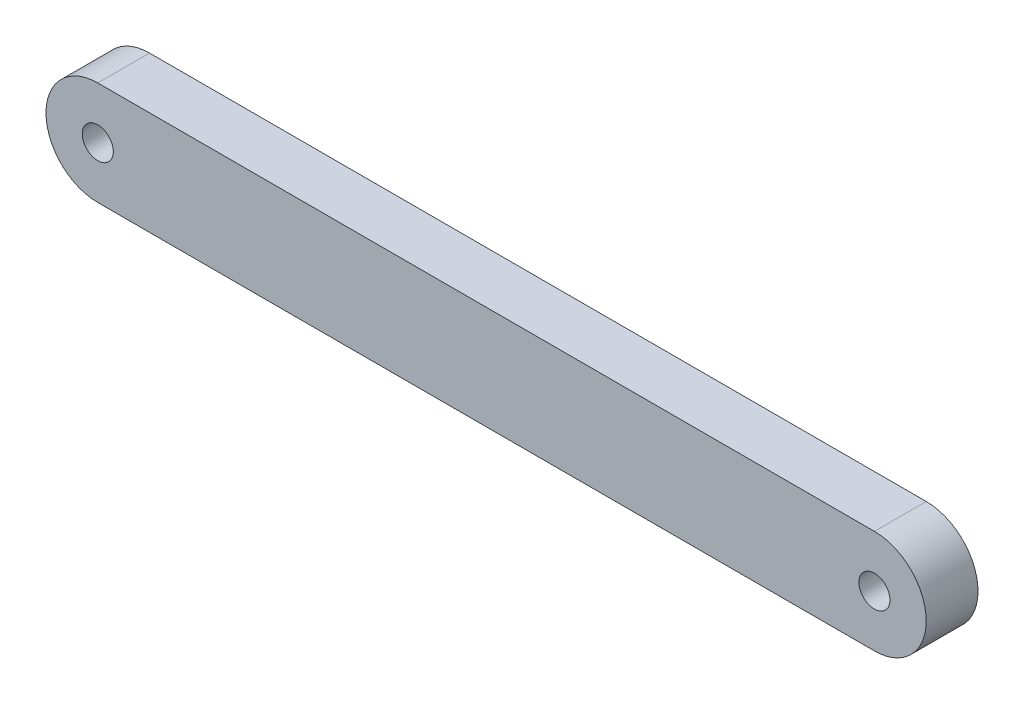
ISO-10303-21;
HEADER;
FILE_DESCRIPTION(('STEP AP214'),'2;1');
FILE_NAME('part.step','',(''),(''),'','','');
FILE_SCHEMA(('AUTOMOTIVE_DESIGN { 1 0 10303 214 1 1 1 1 }'));
ENDSEC;
DATA;
#1=APPLICATION_CONTEXT('core data for automotive mechanical design processes');
#2=APPLICATION_PROTOCOL_DEFINITION('international standard','automotive_design',2000,#1);
#3=PRODUCT_CONTEXT('',#1,'mechanical');
#4=PRODUCT('Part','Part','',(#3));
#5=PRODUCT_RELATED_PRODUCT_CATEGORY('part','',(#4));
#6=PRODUCT_DEFINITION_FORMATION('','',#4);
#7=PRODUCT_DEFINITION_CONTEXT('part definition',#1,'design');
#8=PRODUCT_DEFINITION('design','',#6,#7);
#9=PRODUCT_DEFINITION_SHAPE('','',#8);
#10=(LENGTH_UNIT() NAMED_UNIT(*) SI_UNIT(.MILLI.,.METRE.));
#11=(NAMED_UNIT(*) PLANE_ANGLE_UNIT() SI_UNIT($,.RADIAN.));
#12=(NAMED_UNIT(*) SI_UNIT($,.STERADIAN.) SOLID_ANGLE_UNIT());
#13=UNCERTAINTY_MEASURE_WITH_UNIT(LENGTH_MEASURE(1.E-05),#10,'distance_accuracy_value','');
#14=(GEOMETRIC_REPRESENTATION_CONTEXT(3) GLOBAL_UNCERTAINTY_ASSIGNED_CONTEXT((#13)) GLOBAL_UNIT_ASSIGNED_CONTEXT((#10,
#11,#12)) REPRESENTATION_CONTEXT('',''));
#15=CARTESIAN_POINT('',(0.,0.,0.));
#16=DIRECTION('',(0.,0.,1.));
#17=DIRECTION('',(1.,0.,0.));
#18=AXIS2_PLACEMENT_3D('',#15,#16,#17);
#19=CARTESIAN_POINT('',(-375.,0.,25.));
#20=DIRECTION('',(0.,0.,-1.));
#21=DIRECTION('',(-1.,0.,0.));
#22=AXIS2_PLACEMENT_3D('',#19,#20,#21);
#23=CYLINDRICAL_SURFACE('',#22,50.);
#24=CARTESIAN_POINT('',(-375.,0.,-25.));
#25=DIRECTION('',(0.,0.,1.));
#26=DIRECTION('',(1.,0.,0.));
#27=AXIS2_PLACEMENT_3D('',#24,#25,#26);
#28=CIRCLE('',#27,50.);
#29=CARTESIAN_POINT('',(-375.,50.,-25.));
#30=VERTEX_POINT('',#29);
#31=CARTESIAN_POINT('',(-375.,-50.,-25.));
#32=VERTEX_POINT('',#31);
#33=EDGE_CURVE('E100',#30,#32,#28,.T.);
#34=ORIENTED_EDGE('',*,*,#33,.T.);
#35=DIRECTION('',(0.,0.,-1.));
#36=VECTOR('',#35,1.);
#37=CARTESIAN_POINT('',(-375.,-50.,25.));
#38=LINE('',#37,#36);
#39=CARTESIAN_POINT('',(-375.,-50.,25.));
#40=VERTEX_POINT('',#39);
#41=EDGE_CURVE('E11',#40,#32,#38,.T.);
#42=ORIENTED_EDGE('',*,*,#41,.F.);
#43=CARTESIAN_POINT('',(-375.,0.,25.));
#44=DIRECTION('',(0.,0.,1.));
#45=DIRECTION('',(1.,0.,0.));
#46=AXIS2_PLACEMENT_3D('',#43,#44,#45);
#47=CIRCLE('',#46,50.);
#48=CARTESIAN_POINT('',(-375.,50.,25.));
#49=VERTEX_POINT('',#48);
#50=EDGE_CURVE('E88',#49,#40,#47,.T.);
#51=ORIENTED_EDGE('',*,*,#50,.F.);
#52=DIRECTION('',(0.,0.,-1.));
#53=VECTOR('',#52,1.);
#54=CARTESIAN_POINT('',(-375.,50.,25.));
#55=LINE('',#54,#53);
#56=EDGE_CURVE('E96',#49,#30,#55,.T.);
#57=ORIENTED_EDGE('',*,*,#56,.T.);
#58=EDGE_LOOP('',(#34,#42,#51,#57));
#59=FACE_BOUND('',#58,.T.);
#60=ADVANCED_FACE('F37',(#59),#23,.T.);
#61=CARTESIAN_POINT('',(-375.,-50.,25.));
#62=DIRECTION('',(0.,1.,0.));
#63=DIRECTION('',(0.,0.,1.));
#64=AXIS2_PLACEMENT_3D('',#61,#62,#63);
#65=PLANE('',#64);
#66=DIRECTION('',(1.,0.,0.));
#67=VECTOR('',#66,1.);
#68=CARTESIAN_POINT('',(-375.,-50.,-25.));
#69=LINE('',#68,#67);
#70=CARTESIAN_POINT('',(375.,-50.0000000000001,-25.));
#71=VERTEX_POINT('',#70);
#72=EDGE_CURVE('E92',#32,#71,#69,.T.);
#73=ORIENTED_EDGE('',*,*,#72,.T.);
#74=DIRECTION('',(0.,0.,-1.));
#75=VECTOR('',#74,1.);
#76=CARTESIAN_POINT('',(375.,-50.0000000000001,25.));
#77=LINE('',#76,#75);
#78=CARTESIAN_POINT('',(375.,-50.0000000000001,25.));
#79=VERTEX_POINT('',#78);
#80=EDGE_CURVE('E45',#79,#71,#77,.T.);
#81=ORIENTED_EDGE('',*,*,#80,.F.);
#82=DIRECTION('',(1.,0.,0.));
#83=VECTOR('',#82,1.);
#84=CARTESIAN_POINT('',(-375.,-50.,25.));
#85=LINE('',#84,#83);
#86=EDGE_CURVE('E83',#40,#79,#85,.T.);
#87=ORIENTED_EDGE('',*,*,#86,.F.);
#88=ORIENTED_EDGE('',*,*,#41,.T.);
#89=EDGE_LOOP('',(#73,#81,#87,#88));
#90=FACE_BOUND('',#89,.T.);
#91=ADVANCED_FACE('F91',(#90),#65,.F.);
#92=CARTESIAN_POINT('',(375.,0.,25.));
#93=DIRECTION('',(0.,0.,-1.));
#94=DIRECTION('',(-1.,0.,0.));
#95=AXIS2_PLACEMENT_3D('',#92,#93,#94);
#96=CYLINDRICAL_SURFACE('',#95,50.0000000000001);
#97=CARTESIAN_POINT('',(375.,0.,-25.));
#98=DIRECTION('',(0.,0.,1.));
#99=DIRECTION('',(1.,0.,0.));
#100=AXIS2_PLACEMENT_3D('',#97,#98,#99);
#101=CIRCLE('',#100,50.0000000000001);
#102=CARTESIAN_POINT('',(375.,50.0000000000002,-25.));
#103=VERTEX_POINT('',#102);
#104=EDGE_CURVE('E70',#71,#103,#101,.T.);
#105=ORIENTED_EDGE('',*,*,#104,.T.);
#106=DIRECTION('',(0.,0.,-1.));
#107=VECTOR('',#106,1.);
#108=CARTESIAN_POINT('',(375.,50.0000000000002,25.));
#109=LINE('',#108,#107);
#110=CARTESIAN_POINT('',(375.,50.0000000000002,25.));
#111=VERTEX_POINT('',#110);
#112=EDGE_CURVE('E93',#111,#103,#109,.T.);
#113=ORIENTED_EDGE('',*,*,#112,.F.);
#114=CARTESIAN_POINT('',(375.,0.,25.));
#115=DIRECTION('',(0.,0.,1.));
#116=DIRECTION('',(1.,0.,0.));
#117=AXIS2_PLACEMENT_3D('',#114,#115,#116);
#118=CIRCLE('',#117,50.0000000000001);
#119=EDGE_CURVE('E86',#79,#111,#118,.T.);
#120=ORIENTED_EDGE('',*,*,#119,.F.);
#121=ORIENTED_EDGE('',*,*,#80,.T.);
#122=EDGE_LOOP('',(#105,#113,#120,#121));
#123=FACE_BOUND('',#122,.T.);
#124=ADVANCED_FACE('F94',(#123),#96,.T.);
#125=CARTESIAN_POINT('',(-375.,50.,25.));
#126=DIRECTION('',(0.,-1.,0.));
#127=DIRECTION('',(1.,0.,0.));
#128=AXIS2_PLACEMENT_3D('',#125,#126,#127);
#129=PLANE('',#128);
#130=DIRECTION('',(-1.,0.,0.));
#131=VECTOR('',#130,1.);
#132=CARTESIAN_POINT('',(-375.,50.,-25.));
#133=LINE('',#132,#131);
#134=EDGE_CURVE('E76',#103,#30,#133,.T.);
#135=ORIENTED_EDGE('',*,*,#134,.T.);
#136=ORIENTED_EDGE('',*,*,#56,.F.);
#137=DIRECTION('',(-1.,0.,0.));
#138=VECTOR('',#137,1.);
#139=CARTESIAN_POINT('',(-375.,50.,25.));
#140=LINE('',#139,#138);
#141=EDGE_CURVE('E53',#111,#49,#140,.T.);
#142=ORIENTED_EDGE('',*,*,#141,.F.);
#143=ORIENTED_EDGE('',*,*,#112,.T.);
#144=EDGE_LOOP('',(#135,#136,#142,#143));
#145=FACE_BOUND('',#144,.T.);
#146=ADVANCED_FACE('F108',(#145),#129,.F.);
#147=CARTESIAN_POINT('',(-375.,0.,25.));
#148=DIRECTION('',(0.,0.,1.));
#149=DIRECTION('',(1.,0.,0.));
#150=AXIS2_PLACEMENT_3D('',#147,#148,#149);
#151=PLANE('',#150);
#152=CARTESIAN_POINT('',(-375.,0.,25.));
#153=DIRECTION('',(0.,0.,1.));
#154=DIRECTION('',(1.,0.,0.));
#155=AXIS2_PLACEMENT_3D('',#152,#153,#154);
#156=CIRCLE('',#155,15.);
#157=CARTESIAN_POINT('',(-360.,0.,25.));
#158=VERTEX_POINT('',#157);
#159=EDGE_CURVE('E120',#158,#158,#156,.T.);
#160=ORIENTED_EDGE('',*,*,#159,.F.);
#161=EDGE_LOOP('',(#160));
#162=FACE_BOUND('',#161,.T.);
#163=CARTESIAN_POINT('',(375.,0.,25.));
#164=DIRECTION('',(0.,0.,1.));
#165=DIRECTION('',(1.,0.,0.));
#166=AXIS2_PLACEMENT_3D('',#163,#164,#165);
#167=CIRCLE('',#166,15.);
#168=CARTESIAN_POINT('',(390.,0.,25.));
#169=VERTEX_POINT('',#168);
#170=EDGE_CURVE('E117',#169,#169,#167,.T.);
#171=ORIENTED_EDGE('',*,*,#170,.F.);
#172=EDGE_LOOP('',(#171));
#173=FACE_BOUND('',#172,.T.);
#174=ORIENTED_EDGE('',*,*,#50,.T.);
#175=ORIENTED_EDGE('',*,*,#86,.T.);
#176=ORIENTED_EDGE('',*,*,#119,.T.);
#177=ORIENTED_EDGE('',*,*,#141,.T.);
#178=EDGE_LOOP('',(#174,#175,#176,#177));
#179=FACE_BOUND('',#178,.T.);
#180=ADVANCED_FACE('F84',(#162,#173,#179),#151,.T.);
#181=CARTESIAN_POINT('',(-375.,0.,-25.));
#182=DIRECTION('',(0.,0.,1.));
#183=DIRECTION('',(1.,0.,0.));
#184=AXIS2_PLACEMENT_3D('',#181,#182,#183);
#185=PLANE('',#184);
#186=CARTESIAN_POINT('',(-375.,0.,-25.));
#187=DIRECTION('',(0.,0.,1.));
#188=DIRECTION('',(1.,0.,0.));
#189=AXIS2_PLACEMENT_3D('',#186,#187,#188);
#190=CIRCLE('',#189,15.);
#191=CARTESIAN_POINT('',(-360.,0.,-25.));
#192=VERTEX_POINT('',#191);
#193=EDGE_CURVE('E103',#192,#192,#190,.T.);
#194=ORIENTED_EDGE('',*,*,#193,.T.);
#195=EDGE_LOOP('',(#194));
#196=FACE_BOUND('',#195,.T.);
#197=CARTESIAN_POINT('',(375.,0.,-25.));
#198=DIRECTION('',(0.,0.,1.));
#199=DIRECTION('',(1.,0.,0.));
#200=AXIS2_PLACEMENT_3D('',#197,#198,#199);
#201=CIRCLE('',#200,15.);
#202=CARTESIAN_POINT('',(390.,0.,-25.));
#203=VERTEX_POINT('',#202);
#204=EDGE_CURVE('E114',#203,#203,#201,.T.);
#205=ORIENTED_EDGE('',*,*,#204,.T.);
#206=EDGE_LOOP('',(#205));
#207=FACE_BOUND('',#206,.T.);
#208=ORIENTED_EDGE('',*,*,#33,.F.);
#209=ORIENTED_EDGE('',*,*,#134,.F.);
#210=ORIENTED_EDGE('',*,*,#104,.F.);
#211=ORIENTED_EDGE('',*,*,#72,.F.);
#212=EDGE_LOOP('',(#208,#209,#210,#211));
#213=FACE_BOUND('',#212,.T.);
#214=ADVANCED_FACE('F111',(#196,#207,#213),#185,.F.);
#215=CARTESIAN_POINT('',(375.,0.,-25.));
#216=DIRECTION('',(0.,0.,1.));
#217=DIRECTION('',(1.,0.,0.));
#218=AXIS2_PLACEMENT_3D('',#215,#216,#217);
#219=CYLINDRICAL_SURFACE('',#218,15.);
#220=ORIENTED_EDGE('',*,*,#204,.F.);
#221=EDGE_LOOP('',(#220));
#222=FACE_BOUND('',#221,.T.);
#223=ORIENTED_EDGE('',*,*,#170,.T.);
#224=EDGE_LOOP('',(#223));
#225=FACE_BOUND('',#224,.T.);
#226=ADVANCED_FACE('F131',(#222,#225),#219,.F.);
#227=CARTESIAN_POINT('',(-375.,0.,-25.));
#228=DIRECTION('',(0.,0.,1.));
#229=DIRECTION('',(1.,0.,0.));
#230=AXIS2_PLACEMENT_3D('',#227,#228,#229);
#231=CYLINDRICAL_SURFACE('',#230,15.);
#232=ORIENTED_EDGE('',*,*,#193,.F.);
#233=EDGE_LOOP('',(#232));
#234=FACE_BOUND('',#233,.T.);
#235=ORIENTED_EDGE('',*,*,#159,.T.);
#236=EDGE_LOOP('',(#235));
#237=FACE_BOUND('',#236,.T.);
#238=ADVANCED_FACE('F128',(#234,#237),#231,.F.);
#239=CLOSED_SHELL('',(#60,#91,#124,#146,#180,#214,#226,#238));
#240=MANIFOLD_SOLID_BREP('B2',#239);
#241=ADVANCED_BREP_SHAPE_REPRESENTATION('',(#18,#240),#14);
#242=SHAPE_DEFINITION_REPRESENTATION(#9,#241);
ENDSEC;
END-ISO-10303-21;
